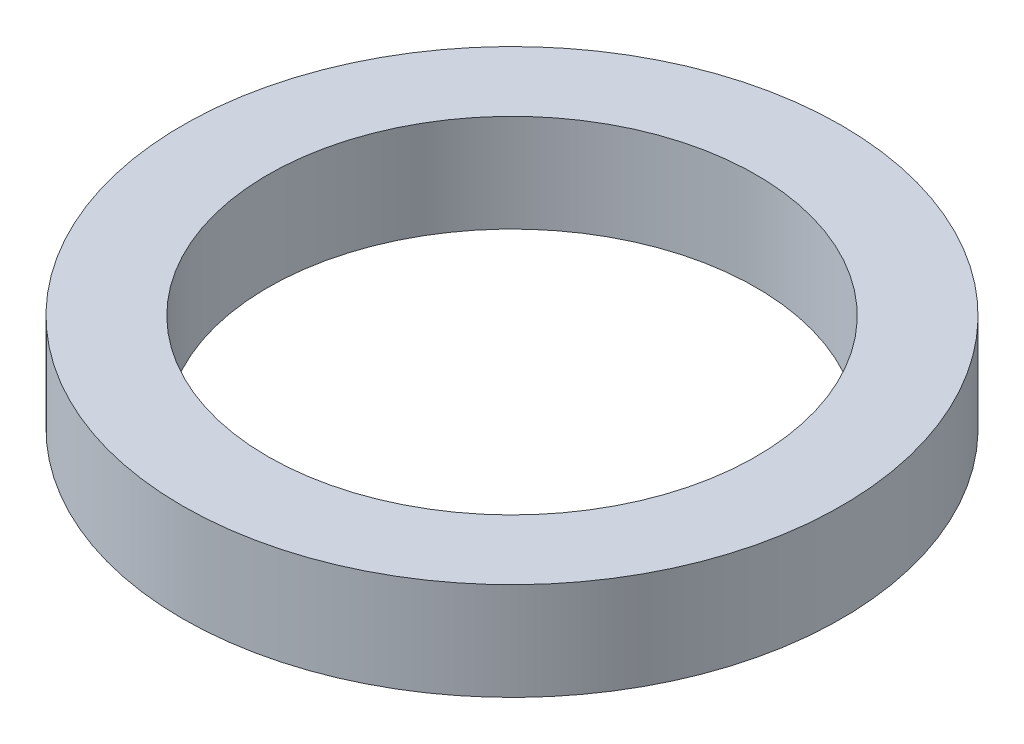
ISO-10303-21;
HEADER;
FILE_DESCRIPTION(('STEP AP214'),'2;1');
FILE_NAME('part.step','',(''),(''),'','','');
FILE_SCHEMA(('AUTOMOTIVE_DESIGN { 1 0 10303 214 1 1 1 1 }'));
ENDSEC;
DATA;
#1=APPLICATION_CONTEXT('core data for automotive mechanical design processes');
#2=APPLICATION_PROTOCOL_DEFINITION('international standard','automotive_design',2000,#1);
#3=PRODUCT_CONTEXT('',#1,'mechanical');
#4=PRODUCT('Part','Part','',(#3));
#5=PRODUCT_RELATED_PRODUCT_CATEGORY('part','',(#4));
#6=PRODUCT_DEFINITION_FORMATION('','',#4);
#7=PRODUCT_DEFINITION_CONTEXT('part definition',#1,'design');
#8=PRODUCT_DEFINITION('design','',#6,#7);
#9=PRODUCT_DEFINITION_SHAPE('','',#8);
#10=(LENGTH_UNIT() NAMED_UNIT(*) SI_UNIT(.MILLI.,.METRE.));
#11=(NAMED_UNIT(*) PLANE_ANGLE_UNIT() SI_UNIT($,.RADIAN.));
#12=(NAMED_UNIT(*) SI_UNIT($,.STERADIAN.) SOLID_ANGLE_UNIT());
#13=UNCERTAINTY_MEASURE_WITH_UNIT(LENGTH_MEASURE(1.E-05),#10,'distance_accuracy_value','');
#14=(GEOMETRIC_REPRESENTATION_CONTEXT(3) GLOBAL_UNCERTAINTY_ASSIGNED_CONTEXT((#13)) GLOBAL_UNIT_ASSIGNED_CONTEXT((#10,
#11,#12)) REPRESENTATION_CONTEXT('',''));
#15=CARTESIAN_POINT('',(0.,0.,0.));
#16=DIRECTION('',(0.,0.,1.));
#17=DIRECTION('',(1.,0.,0.));
#18=AXIS2_PLACEMENT_3D('',#15,#16,#17);
#19=CARTESIAN_POINT('',(0.,4.,0.));
#20=DIRECTION('',(0.,1.,0.));
#21=DIRECTION('',(0.,0.,1.));
#22=AXIS2_PLACEMENT_3D('',#19,#20,#21);
#23=PLANE('',#22);
#24=CARTESIAN_POINT('',(0.,4.,0.));
#25=DIRECTION('',(0.,1.,0.));
#26=DIRECTION('',(0.,0.,1.));
#27=AXIS2_PLACEMENT_3D('',#24,#25,#26);
#28=CIRCLE('',#27,13.5);
#29=CARTESIAN_POINT('',(0.,4.,13.5));
#30=VERTEX_POINT('',#29);
#31=EDGE_CURVE('E10',#30,#30,#28,.T.);
#32=ORIENTED_EDGE('',*,*,#31,.T.);
#33=EDGE_LOOP('',(#32));
#34=FACE_BOUND('',#33,.T.);
#35=CARTESIAN_POINT('',(0.,4.,0.));
#36=DIRECTION('',(0.,1.,0.));
#37=DIRECTION('',(0.,0.,1.));
#38=AXIS2_PLACEMENT_3D('',#35,#36,#37);
#39=CIRCLE('',#38,10.);
#40=CARTESIAN_POINT('',(0.,4.,10.));
#41=VERTEX_POINT('',#40);
#42=EDGE_CURVE('E46',#41,#41,#39,.T.);
#43=ORIENTED_EDGE('',*,*,#42,.F.);
#44=EDGE_LOOP('',(#43));
#45=FACE_BOUND('',#44,.T.);
#46=ADVANCED_FACE('F35',(#34,#45),#23,.T.);
#47=CARTESIAN_POINT('',(0.,0.,0.));
#48=DIRECTION('',(0.,1.,0.));
#49=DIRECTION('',(0.,0.,1.));
#50=AXIS2_PLACEMENT_3D('',#47,#48,#49);
#51=PLANE('',#50);
#52=CARTESIAN_POINT('',(0.,0.,0.));
#53=DIRECTION('',(0.,1.,0.));
#54=DIRECTION('',(0.,0.,1.));
#55=AXIS2_PLACEMENT_3D('',#52,#53,#54);
#56=CIRCLE('',#55,13.5);
#57=CARTESIAN_POINT('',(0.,0.,13.5));
#58=VERTEX_POINT('',#57);
#59=EDGE_CURVE('E39',#58,#58,#56,.T.);
#60=ORIENTED_EDGE('',*,*,#59,.F.);
#61=EDGE_LOOP('',(#60));
#62=FACE_BOUND('',#61,.T.);
#63=CARTESIAN_POINT('',(0.,0.,0.));
#64=DIRECTION('',(0.,1.,0.));
#65=DIRECTION('',(0.,0.,1.));
#66=AXIS2_PLACEMENT_3D('',#63,#64,#65);
#67=CIRCLE('',#66,10.);
#68=CARTESIAN_POINT('',(0.,0.,10.));
#69=VERTEX_POINT('',#68);
#70=EDGE_CURVE('E48',#69,#69,#67,.T.);
#71=ORIENTED_EDGE('',*,*,#70,.T.);
#72=EDGE_LOOP('',(#71));
#73=FACE_BOUND('',#72,.T.);
#74=ADVANCED_FACE('F58',(#62,#73),#51,.F.);
#75=CARTESIAN_POINT('',(0.,4.,0.));
#76=DIRECTION('',(0.,-1.,0.));
#77=DIRECTION('',(0.,0.,-1.));
#78=AXIS2_PLACEMENT_3D('',#75,#76,#77);
#79=CYLINDRICAL_SURFACE('',#78,13.5);
#80=ORIENTED_EDGE('',*,*,#31,.F.);
#81=EDGE_LOOP('',(#80));
#82=FACE_BOUND('',#81,.T.);
#83=ORIENTED_EDGE('',*,*,#59,.T.);
#84=EDGE_LOOP('',(#83));
#85=FACE_BOUND('',#84,.T.);
#86=ADVANCED_FACE('F37',(#82,#85),#79,.T.);
#87=CARTESIAN_POINT('',(0.,4.,0.));
#88=DIRECTION('',(0.,-1.,0.));
#89=DIRECTION('',(0.,0.,-1.));
#90=AXIS2_PLACEMENT_3D('',#87,#88,#89);
#91=CYLINDRICAL_SURFACE('',#90,10.);
#92=ORIENTED_EDGE('',*,*,#42,.T.);
#93=EDGE_LOOP('',(#92));
#94=FACE_BOUND('',#93,.T.);
#95=ORIENTED_EDGE('',*,*,#70,.F.);
#96=EDGE_LOOP('',(#95));
#97=FACE_BOUND('',#96,.T.);
#98=ADVANCED_FACE('F54',(#94,#97),#91,.F.);
#99=CLOSED_SHELL('',(#46,#74,#86,#98));
#100=MANIFOLD_SOLID_BREP('B2',#99);
#101=ADVANCED_BREP_SHAPE_REPRESENTATION('',(#18,#100),#14);
#102=SHAPE_DEFINITION_REPRESENTATION(#9,#101);
ENDSEC;
END-ISO-10303-21;
